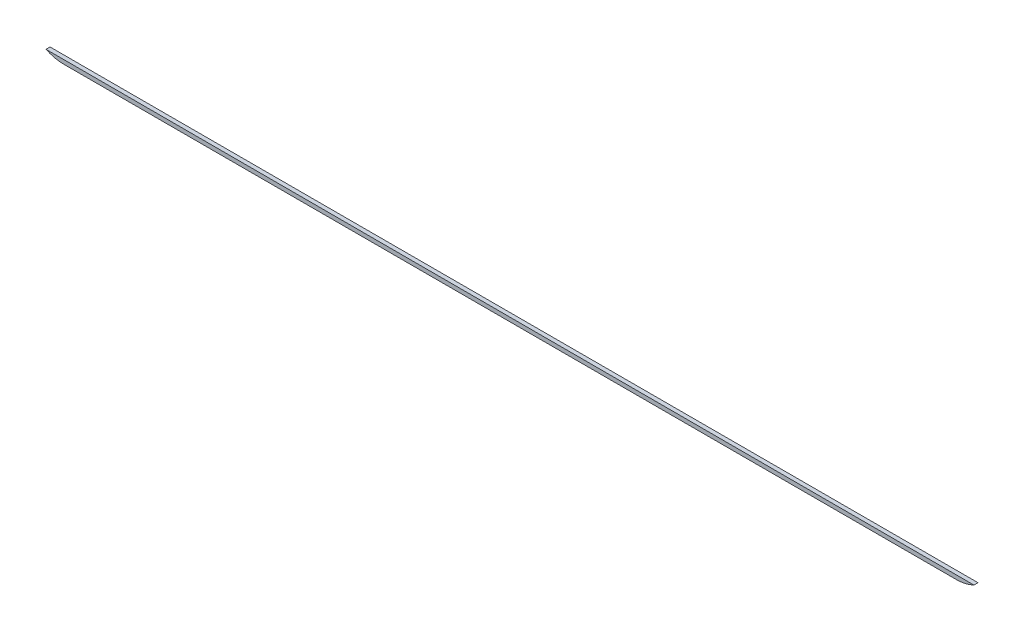
ISO-10303-21;
HEADER;
FILE_DESCRIPTION(('STEP AP214'),'2;1');
FILE_NAME('part.step','',(''),(''),'','','');
FILE_SCHEMA(('AUTOMOTIVE_DESIGN { 1 0 10303 214 1 1 1 1 }'));
ENDSEC;
DATA;
#1=APPLICATION_CONTEXT('core data for automotive mechanical design processes');
#2=APPLICATION_PROTOCOL_DEFINITION('international standard','automotive_design',2000,#1);
#3=PRODUCT_CONTEXT('',#1,'mechanical');
#4=PRODUCT('Part','Part','',(#3));
#5=PRODUCT_RELATED_PRODUCT_CATEGORY('part','',(#4));
#6=PRODUCT_DEFINITION_FORMATION('','',#4);
#7=PRODUCT_DEFINITION_CONTEXT('part definition',#1,'design');
#8=PRODUCT_DEFINITION('design','',#6,#7);
#9=PRODUCT_DEFINITION_SHAPE('','',#8);
#10=(LENGTH_UNIT() NAMED_UNIT(*) SI_UNIT(.MILLI.,.METRE.));
#11=(NAMED_UNIT(*) PLANE_ANGLE_UNIT() SI_UNIT($,.RADIAN.));
#12=(NAMED_UNIT(*) SI_UNIT($,.STERADIAN.) SOLID_ANGLE_UNIT());
#13=UNCERTAINTY_MEASURE_WITH_UNIT(LENGTH_MEASURE(1.E-05),#10,'distance_accuracy_value','');
#14=(GEOMETRIC_REPRESENTATION_CONTEXT(3) GLOBAL_UNCERTAINTY_ASSIGNED_CONTEXT((#13)) GLOBAL_UNIT_ASSIGNED_CONTEXT((#10,
#11,#12)) REPRESENTATION_CONTEXT('',''));
#15=CARTESIAN_POINT('',(0.,0.,0.));
#16=DIRECTION('',(0.,0.,1.));
#17=DIRECTION('',(1.,0.,0.));
#18=AXIS2_PLACEMENT_3D('',#15,#16,#17);
#19=CARTESIAN_POINT('',(0.,-45.,0.));
#20=DIRECTION('',(0.,1.,0.));
#21=DIRECTION('',(0.,0.,1.));
#22=AXIS2_PLACEMENT_3D('',#19,#20,#21);
#23=PLANE('',#22);
#24=DIRECTION('',(0.,0.,-1.));
#25=VECTOR('',#24,1.);
#26=CARTESIAN_POINT('',(619.060752759772,-45.,80.));
#27=LINE('',#26,#25);
#28=CARTESIAN_POINT('',(619.060752759772,-45.,5.));
#29=VERTEX_POINT('',#28);
#30=CARTESIAN_POINT('',(619.060752759772,-45.,0.));
#31=VERTEX_POINT('',#30);
#32=EDGE_CURVE('E76',#29,#31,#27,.T.);
#33=ORIENTED_EDGE('',*,*,#32,.T.);
#34=DIRECTION('',(-1.,0.,0.));
#35=VECTOR('',#34,1.);
#36=CARTESIAN_POINT('',(-502.733741957931,-45.,0.));
#37=LINE('',#36,#35);
#38=CARTESIAN_POINT('',(-524.528236675635,-45.,0.));
#39=VERTEX_POINT('',#38);
#40=EDGE_CURVE('E81',#31,#39,#37,.T.);
#41=ORIENTED_EDGE('',*,*,#40,.T.);
#42=DIRECTION('',(0.,0.,-1.));
#43=VECTOR('',#42,1.);
#44=CARTESIAN_POINT('',(-524.528236675635,-45.,80.));
#45=LINE('',#44,#43);
#46=CARTESIAN_POINT('',(-524.528236675635,-45.,5.));
#47=VERTEX_POINT('',#46);
#48=EDGE_CURVE('E88',#39,#47,#45,.F.);
#49=ORIENTED_EDGE('',*,*,#48,.T.);
#50=DIRECTION('',(-1.,0.,0.));
#51=VECTOR('',#50,1.);
#52=CARTESIAN_POINT('',(597.266258042068,-45.,5.));
#53=LINE('',#52,#51);
#54=EDGE_CURVE('E87',#29,#47,#53,.T.);
#55=ORIENTED_EDGE('',*,*,#54,.F.);
#56=EDGE_LOOP('',(#33,#41,#49,#55));
#57=FACE_BOUND('',#56,.T.);
#58=ADVANCED_FACE('F34',(#57),#23,.T.);
#59=CARTESIAN_POINT('',(-502.733741957931,0.,0.));
#60=DIRECTION('',(0.,0.,1.));
#61=DIRECTION('',(1.,0.,0.));
#62=AXIS2_PLACEMENT_3D('',#59,#60,#61);
#63=PLANE('',#62);
#64=ORIENTED_EDGE('',*,*,#40,.F.);
#65=CARTESIAN_POINT('',(597.266258042068,0.,0.));
#66=DIRECTION('',(0.,0.,1.));
#67=DIRECTION('',(1.,0.,0.));
#68=AXIS2_PLACEMENT_3D('',#65,#66,#67);
#69=CIRCLE('',#68,50.);
#70=CARTESIAN_POINT('',(597.266258042068,-50.,0.));
#71=VERTEX_POINT('',#70);
#72=EDGE_CURVE('E38',#71,#31,#69,.T.);
#73=ORIENTED_EDGE('',*,*,#72,.F.);
#74=DIRECTION('',(1.,0.,0.));
#75=VECTOR('',#74,1.);
#76=CARTESIAN_POINT('',(-502.733741957931,-50.,0.));
#77=LINE('',#76,#75);
#78=CARTESIAN_POINT('',(-502.733741957931,-50.,0.));
#79=VERTEX_POINT('',#78);
#80=EDGE_CURVE('E95',#79,#71,#77,.T.);
#81=ORIENTED_EDGE('',*,*,#80,.F.);
#82=CARTESIAN_POINT('',(-502.733741957931,0.,0.));
#83=DIRECTION('',(0.,0.,1.));
#84=DIRECTION('',(1.,0.,0.));
#85=AXIS2_PLACEMENT_3D('',#82,#83,#84);
#86=CIRCLE('',#85,50.);
#87=EDGE_CURVE('E83',#39,#79,#86,.T.);
#88=ORIENTED_EDGE('',*,*,#87,.F.);
#89=EDGE_LOOP('',(#64,#73,#81,#88));
#90=FACE_BOUND('',#89,.T.);
#91=ADVANCED_FACE('F82',(#90),#63,.F.);
#92=CARTESIAN_POINT('',(-502.733741957931,-50.,80.));
#93=DIRECTION('',(0.,1.,0.));
#94=DIRECTION('',(0.,0.,1.));
#95=AXIS2_PLACEMENT_3D('',#92,#93,#94);
#96=PLANE('',#95);
#97=DIRECTION('',(0.,0.,-1.));
#98=VECTOR('',#97,1.);
#99=CARTESIAN_POINT('',(597.266258042068,-50.,80.));
#100=LINE('',#99,#98);
#101=CARTESIAN_POINT('',(597.266258042068,-50.,5.));
#102=VERTEX_POINT('',#101);
#103=EDGE_CURVE('E55',#102,#71,#100,.T.);
#104=ORIENTED_EDGE('',*,*,#103,.F.);
#105=DIRECTION('',(-1.,0.,0.));
#106=VECTOR('',#105,1.);
#107=CARTESIAN_POINT('',(-502.733741957931,-50.,5.));
#108=LINE('',#107,#106);
#109=CARTESIAN_POINT('',(-502.733741957931,-50.,5.));
#110=VERTEX_POINT('',#109);
#111=EDGE_CURVE('E11',#102,#110,#108,.T.);
#112=ORIENTED_EDGE('',*,*,#111,.T.);
#113=DIRECTION('',(0.,0.,-1.));
#114=VECTOR('',#113,1.);
#115=CARTESIAN_POINT('',(-502.733741957931,-50.,80.));
#116=LINE('',#115,#114);
#117=EDGE_CURVE('E96',#110,#79,#116,.T.);
#118=ORIENTED_EDGE('',*,*,#117,.T.);
#119=ORIENTED_EDGE('',*,*,#80,.T.);
#120=EDGE_LOOP('',(#104,#112,#118,#119));
#121=FACE_BOUND('',#120,.T.);
#122=ADVANCED_FACE('F105',(#121),#96,.F.);
#123=CARTESIAN_POINT('',(-502.733741957931,0.,80.));
#124=DIRECTION('',(0.,0.,-1.));
#125=DIRECTION('',(-1.,0.,0.));
#126=AXIS2_PLACEMENT_3D('',#123,#124,#125);
#127=CYLINDRICAL_SURFACE('',#126,50.);
#128=ORIENTED_EDGE('',*,*,#48,.F.);
#129=ORIENTED_EDGE('',*,*,#87,.T.);
#130=ORIENTED_EDGE('',*,*,#117,.F.);
#131=CARTESIAN_POINT('',(-502.733741957931,0.,5.));
#132=DIRECTION('',(0.,0.,1.));
#133=DIRECTION('',(1.,0.,0.));
#134=AXIS2_PLACEMENT_3D('',#131,#132,#133);
#135=CIRCLE('',#134,50.);
#136=EDGE_CURVE('E93',#47,#110,#135,.T.);
#137=ORIENTED_EDGE('',*,*,#136,.F.);
#138=EDGE_LOOP('',(#128,#129,#130,#137));
#139=FACE_BOUND('',#138,.T.);
#140=ADVANCED_FACE('F108',(#139),#127,.T.);
#141=CARTESIAN_POINT('',(597.266258042068,0.,80.));
#142=DIRECTION('',(0.,0.,-1.));
#143=DIRECTION('',(-1.,0.,0.));
#144=AXIS2_PLACEMENT_3D('',#141,#142,#143);
#145=CYLINDRICAL_SURFACE('',#144,50.);
#146=ORIENTED_EDGE('',*,*,#32,.F.);
#147=CARTESIAN_POINT('',(597.266258042068,0.,5.));
#148=DIRECTION('',(0.,0.,1.));
#149=DIRECTION('',(1.,0.,0.));
#150=AXIS2_PLACEMENT_3D('',#147,#148,#149);
#151=CIRCLE('',#150,50.);
#152=EDGE_CURVE('E97',#102,#29,#151,.T.);
#153=ORIENTED_EDGE('',*,*,#152,.F.);
#154=ORIENTED_EDGE('',*,*,#103,.T.);
#155=ORIENTED_EDGE('',*,*,#72,.T.);
#156=EDGE_LOOP('',(#146,#153,#154,#155));
#157=FACE_BOUND('',#156,.T.);
#158=ADVANCED_FACE('F74',(#157),#145,.T.);
#159=CARTESIAN_POINT('',(597.266258042068,-45.,5.));
#160=DIRECTION('',(0.,0.,1.));
#161=DIRECTION('',(1.,0.,0.));
#162=AXIS2_PLACEMENT_3D('',#159,#160,#161);
#163=PLANE('',#162);
#164=ORIENTED_EDGE('',*,*,#152,.T.);
#165=ORIENTED_EDGE('',*,*,#54,.T.);
#166=ORIENTED_EDGE('',*,*,#136,.T.);
#167=ORIENTED_EDGE('',*,*,#111,.F.);
#168=EDGE_LOOP('',(#164,#165,#166,#167));
#169=FACE_BOUND('',#168,.T.);
#170=ADVANCED_FACE('F36',(#169),#163,.T.);
#171=CLOSED_SHELL('',(#58,#91,#122,#140,#158,#170));
#172=MANIFOLD_SOLID_BREP('B2',#171);
#173=ADVANCED_BREP_SHAPE_REPRESENTATION('',(#18,#172),#14);
#174=SHAPE_DEFINITION_REPRESENTATION(#9,#173);
ENDSEC;
END-ISO-10303-21;
